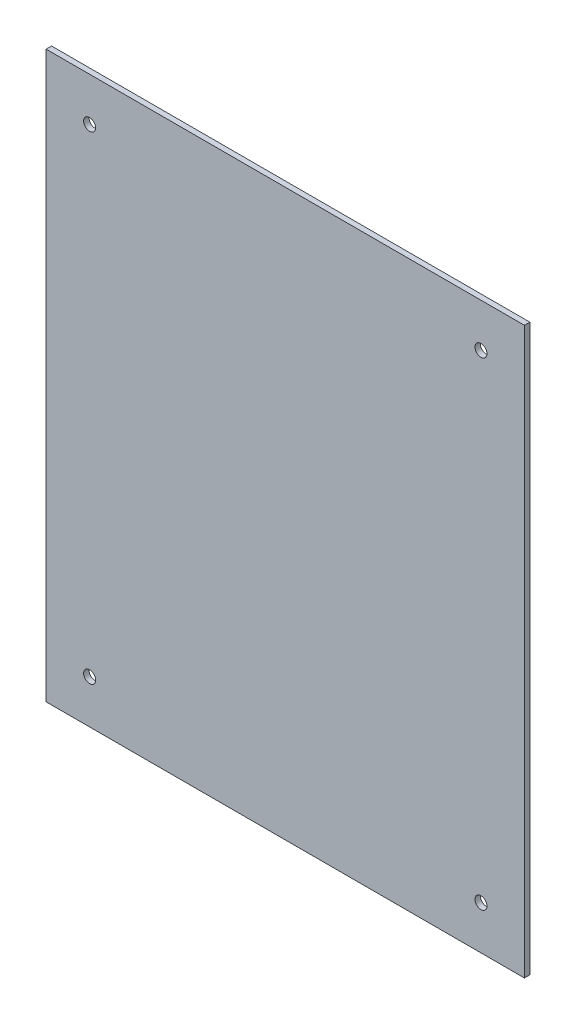
ISO-10303-21;
HEADER;
FILE_DESCRIPTION(('STEP AP214'),'2;1');
FILE_NAME('part.step','',(''),(''),'','','');
FILE_SCHEMA(('AUTOMOTIVE_DESIGN { 1 0 10303 214 1 1 1 1 }'));
ENDSEC;
DATA;
#1=APPLICATION_CONTEXT('core data for automotive mechanical design processes');
#2=APPLICATION_PROTOCOL_DEFINITION('international standard','automotive_design',2000,#1);
#3=PRODUCT_CONTEXT('',#1,'mechanical');
#4=PRODUCT('Part','Part','',(#3));
#5=PRODUCT_RELATED_PRODUCT_CATEGORY('part','',(#4));
#6=PRODUCT_DEFINITION_FORMATION('','',#4);
#7=PRODUCT_DEFINITION_CONTEXT('part definition',#1,'design');
#8=PRODUCT_DEFINITION('design','',#6,#7);
#9=PRODUCT_DEFINITION_SHAPE('','',#8);
#10=(LENGTH_UNIT() NAMED_UNIT(*) SI_UNIT(.MILLI.,.METRE.));
#11=(NAMED_UNIT(*) PLANE_ANGLE_UNIT() SI_UNIT($,.RADIAN.));
#12=(NAMED_UNIT(*) SI_UNIT($,.STERADIAN.) SOLID_ANGLE_UNIT());
#13=UNCERTAINTY_MEASURE_WITH_UNIT(LENGTH_MEASURE(1.E-05),#10,'distance_accuracy_value','');
#14=(GEOMETRIC_REPRESENTATION_CONTEXT(3) GLOBAL_UNCERTAINTY_ASSIGNED_CONTEXT((#13)) GLOBAL_UNIT_ASSIGNED_CONTEXT((#10,
#11,#12)) REPRESENTATION_CONTEXT('',''));
#15=CARTESIAN_POINT('',(0.,0.,0.));
#16=DIRECTION('',(0.,0.,1.));
#17=DIRECTION('',(1.,0.,0.));
#18=AXIS2_PLACEMENT_3D('',#15,#16,#17);
#19=CARTESIAN_POINT('',(0.,0.,3.175));
#20=DIRECTION('',(0.,0.,-1.));
#21=DIRECTION('',(-1.,0.,0.));
#22=AXIS2_PLACEMENT_3D('',#19,#20,#21);
#23=PLANE('',#22);
#24=DIRECTION('',(0.,1.,0.));
#25=VECTOR('',#24,1.);
#26=CARTESIAN_POINT('',(139.7,-165.1,3.175));
#27=LINE('',#26,#25);
#28=CARTESIAN_POINT('',(139.7,-165.1,3.175));
#29=VERTEX_POINT('',#28);
#30=CARTESIAN_POINT('',(139.7,165.1,3.175));
#31=VERTEX_POINT('',#30);
#32=EDGE_CURVE('E99',#29,#31,#27,.T.);
#33=ORIENTED_EDGE('',*,*,#32,.T.);
#34=DIRECTION('',(-1.,0.,0.));
#35=VECTOR('',#34,1.);
#36=CARTESIAN_POINT('',(-139.7,165.1,3.175));
#37=LINE('',#36,#35);
#38=CARTESIAN_POINT('',(-139.7,165.1,3.175));
#39=VERTEX_POINT('',#38);
#40=EDGE_CURVE('E94',#31,#39,#37,.T.);
#41=ORIENTED_EDGE('',*,*,#40,.T.);
#42=DIRECTION('',(0.,-1.,0.));
#43=VECTOR('',#42,1.);
#44=CARTESIAN_POINT('',(-139.7,-165.1,3.175));
#45=LINE('',#44,#43);
#46=CARTESIAN_POINT('',(-139.7,-165.1,3.175));
#47=VERTEX_POINT('',#46);
#48=EDGE_CURVE('E97',#39,#47,#45,.T.);
#49=ORIENTED_EDGE('',*,*,#48,.T.);
#50=DIRECTION('',(1.,0.,0.));
#51=VECTOR('',#50,1.);
#52=CARTESIAN_POINT('',(-139.7,-165.1,3.175));
#53=LINE('',#52,#51);
#54=EDGE_CURVE('E64',#47,#29,#53,.T.);
#55=ORIENTED_EDGE('',*,*,#54,.T.);
#56=EDGE_LOOP('',(#33,#41,#49,#55));
#57=FACE_BOUND('',#56,.T.);
#58=CARTESIAN_POINT('',(-114.3,139.7,3.175));
#59=DIRECTION('',(0.,0.,1.));
#60=DIRECTION('',(1.,0.,0.));
#61=AXIS2_PLACEMENT_3D('',#58,#59,#60);
#62=CIRCLE('',#61,3.50000000000001);
#63=CARTESIAN_POINT('',(-110.8,139.7,3.175));
#64=VERTEX_POINT('',#63);
#65=EDGE_CURVE('E114',#64,#64,#62,.T.);
#66=ORIENTED_EDGE('',*,*,#65,.F.);
#67=EDGE_LOOP('',(#66));
#68=FACE_BOUND('',#67,.T.);
#69=CARTESIAN_POINT('',(114.3,139.7,3.175));
#70=DIRECTION('',(0.,0.,1.));
#71=DIRECTION('',(1.,0.,0.));
#72=AXIS2_PLACEMENT_3D('',#69,#70,#71);
#73=CIRCLE('',#72,3.50000000000001);
#74=CARTESIAN_POINT('',(117.8,139.7,3.175));
#75=VERTEX_POINT('',#74);
#76=EDGE_CURVE('E129',#75,#75,#73,.T.);
#77=ORIENTED_EDGE('',*,*,#76,.F.);
#78=EDGE_LOOP('',(#77));
#79=FACE_BOUND('',#78,.T.);
#80=CARTESIAN_POINT('',(-114.3,-139.7,3.175));
#81=DIRECTION('',(0.,0.,1.));
#82=DIRECTION('',(1.,0.,0.));
#83=AXIS2_PLACEMENT_3D('',#80,#81,#82);
#84=CIRCLE('',#83,3.50000000000001);
#85=CARTESIAN_POINT('',(-110.8,-139.7,3.175));
#86=VERTEX_POINT('',#85);
#87=EDGE_CURVE('E135',#86,#86,#84,.T.);
#88=ORIENTED_EDGE('',*,*,#87,.F.);
#89=EDGE_LOOP('',(#88));
#90=FACE_BOUND('',#89,.T.);
#91=CARTESIAN_POINT('',(114.3,-139.7,3.175));
#92=DIRECTION('',(0.,0.,1.));
#93=DIRECTION('',(1.,0.,0.));
#94=AXIS2_PLACEMENT_3D('',#91,#92,#93);
#95=CIRCLE('',#94,3.50000000000001);
#96=CARTESIAN_POINT('',(117.8,-139.7,3.175));
#97=VERTEX_POINT('',#96);
#98=EDGE_CURVE('E141',#97,#97,#95,.T.);
#99=ORIENTED_EDGE('',*,*,#98,.F.);
#100=EDGE_LOOP('',(#99));
#101=FACE_BOUND('',#100,.T.);
#102=ADVANCED_FACE('F47',(#57,#68,#79,#90,#101),#23,.F.);
#103=CARTESIAN_POINT('',(0.,0.,0.));
#104=DIRECTION('',(0.,0.,-1.));
#105=DIRECTION('',(-1.,0.,0.));
#106=AXIS2_PLACEMENT_3D('',#103,#104,#105);
#107=PLANE('',#106);
#108=CARTESIAN_POINT('',(-114.3,-139.7,0.));
#109=DIRECTION('',(0.,0.,1.));
#110=DIRECTION('',(1.,0.,0.));
#111=AXIS2_PLACEMENT_3D('',#108,#109,#110);
#112=CIRCLE('',#111,3.50000000000001);
#113=CARTESIAN_POINT('',(-110.8,-139.7,0.));
#114=VERTEX_POINT('',#113);
#115=EDGE_CURVE('E138',#114,#114,#112,.T.);
#116=ORIENTED_EDGE('',*,*,#115,.T.);
#117=EDGE_LOOP('',(#116));
#118=FACE_BOUND('',#117,.T.);
#119=CARTESIAN_POINT('',(-114.3,139.7,0.));
#120=DIRECTION('',(0.,0.,1.));
#121=DIRECTION('',(1.,0.,0.));
#122=AXIS2_PLACEMENT_3D('',#119,#120,#121);
#123=CIRCLE('',#122,3.50000000000001);
#124=CARTESIAN_POINT('',(-110.8,139.7,0.));
#125=VERTEX_POINT('',#124);
#126=EDGE_CURVE('E126',#125,#125,#123,.T.);
#127=ORIENTED_EDGE('',*,*,#126,.T.);
#128=EDGE_LOOP('',(#127));
#129=FACE_BOUND('',#128,.T.);
#130=DIRECTION('',(0.,1.,0.));
#131=VECTOR('',#130,1.);
#132=CARTESIAN_POINT('',(139.7,-165.1,0.));
#133=LINE('',#132,#131);
#134=CARTESIAN_POINT('',(139.7,-165.1,0.));
#135=VERTEX_POINT('',#134);
#136=CARTESIAN_POINT('',(139.7,165.1,0.));
#137=VERTEX_POINT('',#136);
#138=EDGE_CURVE('E111',#135,#137,#133,.T.);
#139=ORIENTED_EDGE('',*,*,#138,.F.);
#140=DIRECTION('',(1.,0.,0.));
#141=VECTOR('',#140,1.);
#142=CARTESIAN_POINT('',(-139.7,-165.1,0.));
#143=LINE('',#142,#141);
#144=CARTESIAN_POINT('',(-139.7,-165.1,0.));
#145=VERTEX_POINT('',#144);
#146=EDGE_CURVE('E87',#145,#135,#143,.T.);
#147=ORIENTED_EDGE('',*,*,#146,.F.);
#148=DIRECTION('',(0.,-1.,0.));
#149=VECTOR('',#148,1.);
#150=CARTESIAN_POINT('',(-139.7,-165.1,0.));
#151=LINE('',#150,#149);
#152=CARTESIAN_POINT('',(-139.7,165.1,0.));
#153=VERTEX_POINT('',#152);
#154=EDGE_CURVE('E81',#153,#145,#151,.T.);
#155=ORIENTED_EDGE('',*,*,#154,.F.);
#156=DIRECTION('',(-1.,0.,0.));
#157=VECTOR('',#156,1.);
#158=CARTESIAN_POINT('',(-139.7,165.1,0.));
#159=LINE('',#158,#157);
#160=EDGE_CURVE('E103',#137,#153,#159,.T.);
#161=ORIENTED_EDGE('',*,*,#160,.F.);
#162=EDGE_LOOP('',(#139,#147,#155,#161));
#163=FACE_BOUND('',#162,.T.);
#164=CARTESIAN_POINT('',(114.3,139.7,0.));
#165=DIRECTION('',(0.,0.,1.));
#166=DIRECTION('',(1.,0.,0.));
#167=AXIS2_PLACEMENT_3D('',#164,#165,#166);
#168=CIRCLE('',#167,3.50000000000001);
#169=CARTESIAN_POINT('',(117.8,139.7,0.));
#170=VERTEX_POINT('',#169);
#171=EDGE_CURVE('E132',#170,#170,#168,.T.);
#172=ORIENTED_EDGE('',*,*,#171,.T.);
#173=EDGE_LOOP('',(#172));
#174=FACE_BOUND('',#173,.T.);
#175=CARTESIAN_POINT('',(114.3,-139.7,0.));
#176=DIRECTION('',(0.,0.,1.));
#177=DIRECTION('',(1.,0.,0.));
#178=AXIS2_PLACEMENT_3D('',#175,#176,#177);
#179=CIRCLE('',#178,3.50000000000001);
#180=CARTESIAN_POINT('',(117.8,-139.7,0.));
#181=VERTEX_POINT('',#180);
#182=EDGE_CURVE('E144',#181,#181,#179,.T.);
#183=ORIENTED_EDGE('',*,*,#182,.T.);
#184=EDGE_LOOP('',(#183));
#185=FACE_BOUND('',#184,.T.);
#186=ADVANCED_FACE('F122',(#118,#129,#163,#174,#185),#107,.T.);
#187=CARTESIAN_POINT('',(139.7,-165.1,3.175));
#188=DIRECTION('',(-1.,0.,0.));
#189=DIRECTION('',(0.,0.,1.));
#190=AXIS2_PLACEMENT_3D('',#187,#188,#189);
#191=PLANE('',#190);
#192=ORIENTED_EDGE('',*,*,#138,.T.);
#193=DIRECTION('',(0.,0.,-1.));
#194=VECTOR('',#193,1.);
#195=CARTESIAN_POINT('',(139.7,165.1,3.175));
#196=LINE('',#195,#194);
#197=EDGE_CURVE('E11',#31,#137,#196,.T.);
#198=ORIENTED_EDGE('',*,*,#197,.F.);
#199=ORIENTED_EDGE('',*,*,#32,.F.);
#200=DIRECTION('',(0.,0.,-1.));
#201=VECTOR('',#200,1.);
#202=CARTESIAN_POINT('',(139.7,-165.1,3.175));
#203=LINE('',#202,#201);
#204=EDGE_CURVE('E107',#29,#135,#203,.T.);
#205=ORIENTED_EDGE('',*,*,#204,.T.);
#206=EDGE_LOOP('',(#192,#198,#199,#205));
#207=FACE_BOUND('',#206,.T.);
#208=ADVANCED_FACE('F49',(#207),#191,.F.);
#209=CARTESIAN_POINT('',(-139.7,165.1,3.175));
#210=DIRECTION('',(0.,-1.,0.));
#211=DIRECTION('',(0.,0.,-1.));
#212=AXIS2_PLACEMENT_3D('',#209,#210,#211);
#213=PLANE('',#212);
#214=ORIENTED_EDGE('',*,*,#160,.T.);
#215=DIRECTION('',(0.,0.,-1.));
#216=VECTOR('',#215,1.);
#217=CARTESIAN_POINT('',(-139.7,165.1,3.175));
#218=LINE('',#217,#216);
#219=EDGE_CURVE('E56',#39,#153,#218,.T.);
#220=ORIENTED_EDGE('',*,*,#219,.F.);
#221=ORIENTED_EDGE('',*,*,#40,.F.);
#222=ORIENTED_EDGE('',*,*,#197,.T.);
#223=EDGE_LOOP('',(#214,#220,#221,#222));
#224=FACE_BOUND('',#223,.T.);
#225=ADVANCED_FACE('F102',(#224),#213,.F.);
#226=CARTESIAN_POINT('',(-139.7,-165.1,3.175));
#227=DIRECTION('',(1.,0.,0.));
#228=DIRECTION('',(0.,0.,-1.));
#229=AXIS2_PLACEMENT_3D('',#226,#227,#228);
#230=PLANE('',#229);
#231=ORIENTED_EDGE('',*,*,#154,.T.);
#232=DIRECTION('',(0.,0.,-1.));
#233=VECTOR('',#232,1.);
#234=CARTESIAN_POINT('',(-139.7,-165.1,3.175));
#235=LINE('',#234,#233);
#236=EDGE_CURVE('E104',#47,#145,#235,.T.);
#237=ORIENTED_EDGE('',*,*,#236,.F.);
#238=ORIENTED_EDGE('',*,*,#48,.F.);
#239=ORIENTED_EDGE('',*,*,#219,.T.);
#240=EDGE_LOOP('',(#231,#237,#238,#239));
#241=FACE_BOUND('',#240,.T.);
#242=ADVANCED_FACE('F105',(#241),#230,.F.);
#243=CARTESIAN_POINT('',(-139.7,-165.1,3.175));
#244=DIRECTION('',(0.,1.,0.));
#245=DIRECTION('',(0.,0.,1.));
#246=AXIS2_PLACEMENT_3D('',#243,#244,#245);
#247=PLANE('',#246);
#248=ORIENTED_EDGE('',*,*,#146,.T.);
#249=ORIENTED_EDGE('',*,*,#204,.F.);
#250=ORIENTED_EDGE('',*,*,#54,.F.);
#251=ORIENTED_EDGE('',*,*,#236,.T.);
#252=EDGE_LOOP('',(#248,#249,#250,#251));
#253=FACE_BOUND('',#252,.T.);
#254=ADVANCED_FACE('F119',(#253),#247,.F.);
#255=CARTESIAN_POINT('',(-114.3,139.7,3.175));
#256=DIRECTION('',(0.,0.,-1.));
#257=DIRECTION('',(-1.,0.,0.));
#258=AXIS2_PLACEMENT_3D('',#255,#256,#257);
#259=CYLINDRICAL_SURFACE('',#258,3.50000000000001);
#260=ORIENTED_EDGE('',*,*,#65,.T.);
#261=EDGE_LOOP('',(#260));
#262=FACE_BOUND('',#261,.T.);
#263=ORIENTED_EDGE('',*,*,#126,.F.);
#264=EDGE_LOOP('',(#263));
#265=FACE_BOUND('',#264,.T.);
#266=ADVANCED_FACE('F161',(#262,#265),#259,.F.);
#267=CARTESIAN_POINT('',(114.3,139.7,3.175));
#268=DIRECTION('',(0.,0.,-1.));
#269=DIRECTION('',(-1.,0.,0.));
#270=AXIS2_PLACEMENT_3D('',#267,#268,#269);
#271=CYLINDRICAL_SURFACE('',#270,3.50000000000001);
#272=ORIENTED_EDGE('',*,*,#76,.T.);
#273=EDGE_LOOP('',(#272));
#274=FACE_BOUND('',#273,.T.);
#275=ORIENTED_EDGE('',*,*,#171,.F.);
#276=EDGE_LOOP('',(#275));
#277=FACE_BOUND('',#276,.T.);
#278=ADVANCED_FACE('F229',(#274,#277),#271,.F.);
#279=CARTESIAN_POINT('',(-114.3,-139.7,3.175));
#280=DIRECTION('',(0.,0.,-1.));
#281=DIRECTION('',(-1.,0.,0.));
#282=AXIS2_PLACEMENT_3D('',#279,#280,#281);
#283=CYLINDRICAL_SURFACE('',#282,3.50000000000001);
#284=ORIENTED_EDGE('',*,*,#87,.T.);
#285=EDGE_LOOP('',(#284));
#286=FACE_BOUND('',#285,.T.);
#287=ORIENTED_EDGE('',*,*,#115,.F.);
#288=EDGE_LOOP('',(#287));
#289=FACE_BOUND('',#288,.T.);
#290=ADVANCED_FACE('F240',(#286,#289),#283,.F.);
#291=CARTESIAN_POINT('',(114.3,-139.7,3.175));
#292=DIRECTION('',(0.,0.,-1.));
#293=DIRECTION('',(-1.,0.,0.));
#294=AXIS2_PLACEMENT_3D('',#291,#292,#293);
#295=CYLINDRICAL_SURFACE('',#294,3.50000000000001);
#296=ORIENTED_EDGE('',*,*,#98,.T.);
#297=EDGE_LOOP('',(#296));
#298=FACE_BOUND('',#297,.T.);
#299=ORIENTED_EDGE('',*,*,#182,.F.);
#300=EDGE_LOOP('',(#299));
#301=FACE_BOUND('',#300,.T.);
#302=ADVANCED_FACE('F150',(#298,#301),#295,.F.);
#303=CLOSED_SHELL('',(#102,#186,#208,#225,#242,#254,#266,#278,#290,#302));
#304=MANIFOLD_SOLID_BREP('B2',#303);
#305=ADVANCED_BREP_SHAPE_REPRESENTATION('',(#18,#304),#14);
#306=SHAPE_DEFINITION_REPRESENTATION(#9,#305);
ENDSEC;
END-ISO-10303-21;
